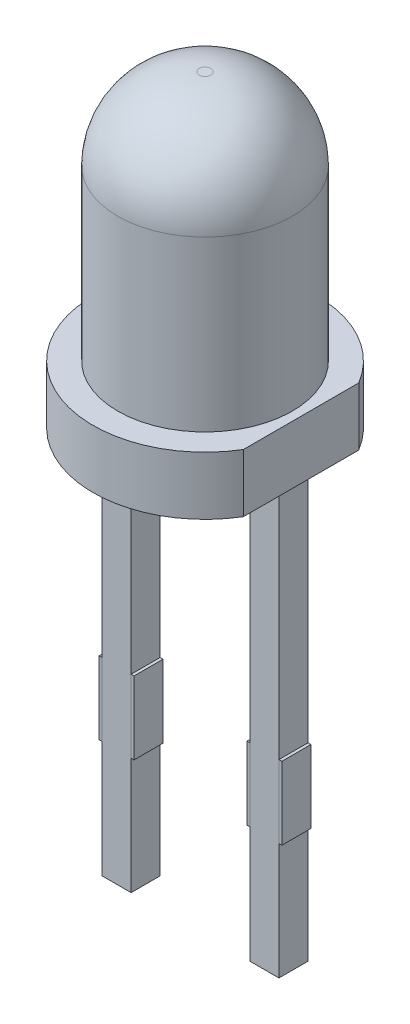
ISO-10303-21;
HEADER;
FILE_DESCRIPTION(('STEP AP214'),'2;1');
FILE_NAME('part.step','',(''),(''),'','','');
FILE_SCHEMA(('AUTOMOTIVE_DESIGN { 1 0 10303 214 1 1 1 1 }'));
ENDSEC;
DATA;
#1=APPLICATION_CONTEXT('core data for automotive mechanical design processes');
#2=APPLICATION_PROTOCOL_DEFINITION('international standard','automotive_design',2000,#1);
#3=PRODUCT_CONTEXT('',#1,'mechanical');
#4=PRODUCT('Part','Part','',(#3));
#5=PRODUCT_RELATED_PRODUCT_CATEGORY('part','',(#4));
#6=PRODUCT_DEFINITION_FORMATION('','',#4);
#7=PRODUCT_DEFINITION_CONTEXT('part definition',#1,'design');
#8=PRODUCT_DEFINITION('design','',#6,#7);
#9=PRODUCT_DEFINITION_SHAPE('','',#8);
#10=(LENGTH_UNIT() NAMED_UNIT(*) SI_UNIT(.MILLI.,.METRE.));
#11=(NAMED_UNIT(*) PLANE_ANGLE_UNIT() SI_UNIT($,.RADIAN.));
#12=(NAMED_UNIT(*) SI_UNIT($,.STERADIAN.) SOLID_ANGLE_UNIT());
#13=UNCERTAINTY_MEASURE_WITH_UNIT(LENGTH_MEASURE(1.E-05),#10,'distance_accuracy_value','');
#14=(GEOMETRIC_REPRESENTATION_CONTEXT(3) GLOBAL_UNCERTAINTY_ASSIGNED_CONTEXT((#13)) GLOBAL_UNIT_ASSIGNED_CONTEXT((#10,
#11,#12)) REPRESENTATION_CONTEXT('',''));
#15=CARTESIAN_POINT('',(0.,0.,0.));
#16=DIRECTION('',(0.,0.,1.));
#17=DIRECTION('',(1.,0.,0.));
#18=AXIS2_PLACEMENT_3D('',#15,#16,#17);
#19=CARTESIAN_POINT('',(-0.970022466230411,1.25,0.249999999999999));
#20=DIRECTION('',(0.,0.,1.));
#21=DIRECTION('',(1.,0.,0.));
#22=AXIS2_PLACEMENT_3D('',#19,#20,#21);
#23=PLANE('',#22);
#24=DIRECTION('',(1.,0.,0.));
#25=VECTOR('',#24,1.);
#26=CARTESIAN_POINT('',(-1.27002246623041,0.,0.249999999999999));
#27=LINE('',#26,#25);
#28=CARTESIAN_POINT('',(-0.970022466230411,0.,0.249999999999999));
#29=VERTEX_POINT('',#28);
#30=CARTESIAN_POINT('',(-1.57002246623041,0.,0.249999999999999));
#31=VERTEX_POINT('',#30);
#32=EDGE_CURVE('P0_E54',#29,#31,#27,.F.);
#33=ORIENTED_EDGE('',*,*,#32,.F.);
#34=DIRECTION('',(0.,1.,0.));
#35=VECTOR('',#34,1.);
#36=CARTESIAN_POINT('',(-0.970022466230411,1.25,0.249999999999999));
#37=LINE('',#36,#35);
#38=CARTESIAN_POINT('',(-0.970022466230411,1.25,0.249999999999999));
#39=VERTEX_POINT('',#38);
#40=EDGE_CURVE('P0_E66',#39,#29,#37,.F.);
#41=ORIENTED_EDGE('',*,*,#40,.F.);
#42=DIRECTION('',(-1.,0.,0.));
#43=VECTOR('',#42,1.);
#44=CARTESIAN_POINT('',(-1.27002246623041,1.25,0.249999999999999));
#45=LINE('',#44,#43);
#46=CARTESIAN_POINT('',(-1.57002246623041,1.25,0.249999999999999));
#47=VERTEX_POINT('',#46);
#48=EDGE_CURVE('P0_E19',#47,#39,#45,.F.);
#49=ORIENTED_EDGE('',*,*,#48,.F.);
#50=DIRECTION('',(0.,1.,0.));
#51=VECTOR('',#50,1.);
#52=CARTESIAN_POINT('',(-1.57002246623041,1.25,0.249999999999999));
#53=LINE('',#52,#51);
#54=EDGE_CURVE('P0_E80',#31,#47,#53,.T.);
#55=ORIENTED_EDGE('',*,*,#54,.F.);
#56=EDGE_LOOP('',(#33,#41,#49,#55));
#57=FACE_BOUND('',#56,.T.);
#58=ADVANCED_FACE('P0_F16',(#57),#23,.T.);
#59=CARTESIAN_POINT('',(-1.27002246623041,1.25,0.));
#60=DIRECTION('',(0.,1.,0.));
#61=DIRECTION('',(-1.,0.,0.));
#62=AXIS2_PLACEMENT_3D('',#59,#60,#61);
#63=PLANE('',#62);
#64=DIRECTION('',(-1.,0.,0.));
#65=VECTOR('',#64,1.);
#66=CARTESIAN_POINT('',(-1.57002246623041,1.25,-0.250000000000001));
#67=LINE('',#66,#65);
#68=CARTESIAN_POINT('',(-1.57002246623041,1.25,-0.250000000000001));
#69=VERTEX_POINT('',#68);
#70=CARTESIAN_POINT('',(-0.970022466230411,1.25,-0.250000000000001));
#71=VERTEX_POINT('',#70);
#72=EDGE_CURVE('P0_E82',#69,#71,#67,.F.);
#73=ORIENTED_EDGE('',*,*,#72,.F.);
#74=DIRECTION('',(0.,0.,1.));
#75=VECTOR('',#74,1.);
#76=CARTESIAN_POINT('',(-1.57002246623041,1.25,0.249999999999999));
#77=LINE('',#76,#75);
#78=EDGE_CURVE('P0_E64',#47,#69,#77,.F.);
#79=ORIENTED_EDGE('',*,*,#78,.F.);
#80=ORIENTED_EDGE('',*,*,#48,.T.);
#81=DIRECTION('',(0.,0.,-1.));
#82=VECTOR('',#81,1.);
#83=CARTESIAN_POINT('',(-0.970022466230411,1.25,-0.250000000000001));
#84=LINE('',#83,#82);
#85=EDGE_CURVE('P0_E61',#71,#39,#84,.F.);
#86=ORIENTED_EDGE('',*,*,#85,.F.);
#87=EDGE_LOOP('',(#73,#79,#80,#86));
#88=FACE_BOUND('',#87,.T.);
#89=ADVANCED_FACE('P0_F59',(#88),#63,.T.);
#90=CARTESIAN_POINT('',(-0.970022466230411,1.25,-0.250000000000001));
#91=DIRECTION('',(1.,0.,0.));
#92=DIRECTION('',(0.,0.,-1.));
#93=AXIS2_PLACEMENT_3D('',#90,#91,#92);
#94=PLANE('',#93);
#95=DIRECTION('',(0.,0.,1.));
#96=VECTOR('',#95,1.);
#97=CARTESIAN_POINT('',(-0.970022466230411,0.,0.));
#98=LINE('',#97,#96);
#99=CARTESIAN_POINT('',(-0.970022466230411,0.,-0.250000000000001));
#100=VERTEX_POINT('',#99);
#101=EDGE_CURVE('P0_E76',#100,#29,#98,.T.);
#102=ORIENTED_EDGE('',*,*,#101,.F.);
#103=DIRECTION('',(0.,1.,0.));
#104=VECTOR('',#103,1.);
#105=CARTESIAN_POINT('',(-0.970022466230411,1.25,-0.250000000000001));
#106=LINE('',#105,#104);
#107=EDGE_CURVE('P0_E72',#71,#100,#106,.F.);
#108=ORIENTED_EDGE('',*,*,#107,.F.);
#109=ORIENTED_EDGE('',*,*,#85,.T.);
#110=ORIENTED_EDGE('',*,*,#40,.T.);
#111=EDGE_LOOP('',(#102,#108,#109,#110));
#112=FACE_BOUND('',#111,.T.);
#113=ADVANCED_FACE('P0_F70',(#112),#94,.T.);
#114=CARTESIAN_POINT('',(-1.27002246623041,0.,0.));
#115=DIRECTION('',(0.,-1.,0.));
#116=DIRECTION('',(1.,0.,0.));
#117=AXIS2_PLACEMENT_3D('',#114,#115,#116);
#118=PLANE('',#117);
#119=DIRECTION('',(-1.,0.,0.));
#120=VECTOR('',#119,1.);
#121=CARTESIAN_POINT('',(-1.57002246623041,0.,-0.250000000000001));
#122=LINE('',#121,#120);
#123=CARTESIAN_POINT('',(-1.57002246623041,0.,-0.250000000000001));
#124=VERTEX_POINT('',#123);
#125=EDGE_CURVE('P0_E25',#100,#124,#122,.T.);
#126=ORIENTED_EDGE('',*,*,#125,.F.);
#127=ORIENTED_EDGE('',*,*,#101,.T.);
#128=ORIENTED_EDGE('',*,*,#32,.T.);
#129=DIRECTION('',(0.,0.,1.));
#130=VECTOR('',#129,1.);
#131=CARTESIAN_POINT('',(-1.57002246623041,0.,0.249999999999999));
#132=LINE('',#131,#130);
#133=EDGE_CURVE('P0_E34',#124,#31,#132,.T.);
#134=ORIENTED_EDGE('',*,*,#133,.F.);
#135=EDGE_LOOP('',(#126,#127,#128,#134));
#136=FACE_BOUND('',#135,.T.);
#137=ADVANCED_FACE('P0_F88',(#136),#118,.T.);
#138=CARTESIAN_POINT('',(-1.57002246623041,1.25,0.249999999999999));
#139=DIRECTION('',(-1.,0.,0.));
#140=DIRECTION('',(0.,0.,1.));
#141=AXIS2_PLACEMENT_3D('',#138,#139,#140);
#142=PLANE('',#141);
#143=ORIENTED_EDGE('',*,*,#133,.T.);
#144=ORIENTED_EDGE('',*,*,#54,.T.);
#145=ORIENTED_EDGE('',*,*,#78,.T.);
#146=DIRECTION('',(0.,1.,0.));
#147=VECTOR('',#146,1.);
#148=CARTESIAN_POINT('',(-1.57002246623041,1.25,-0.250000000000001));
#149=LINE('',#148,#147);
#150=EDGE_CURVE('P0_E11',#124,#69,#149,.T.);
#151=ORIENTED_EDGE('',*,*,#150,.F.);
#152=EDGE_LOOP('',(#143,#144,#145,#151));
#153=FACE_BOUND('',#152,.T.);
#154=ADVANCED_FACE('P0_F90',(#153),#142,.T.);
#155=CARTESIAN_POINT('',(-1.57002246623041,1.25,-0.250000000000001));
#156=DIRECTION('',(0.,0.,-1.));
#157=DIRECTION('',(-1.,0.,0.));
#158=AXIS2_PLACEMENT_3D('',#155,#156,#157);
#159=PLANE('',#158);
#160=ORIENTED_EDGE('',*,*,#125,.T.);
#161=ORIENTED_EDGE('',*,*,#150,.T.);
#162=ORIENTED_EDGE('',*,*,#72,.T.);
#163=ORIENTED_EDGE('',*,*,#107,.T.);
#164=EDGE_LOOP('',(#160,#161,#162,#163));
#165=FACE_BOUND('',#164,.T.);
#166=ADVANCED_FACE('P0_F87',(#165),#159,.T.);
#167=CLOSED_SHELL('',(#58,#89,#113,#137,#154,#166));
#168=MANIFOLD_SOLID_BREP('P0_B1',#167);
#169=CARTESIAN_POINT('',(-1.01999994039536,5.3,0.249999999999999));
#170=DIRECTION('',(0.,0.,1.));
#171=DIRECTION('',(1.,0.,0.));
#172=AXIS2_PLACEMENT_3D('',#169,#170,#171);
#173=PLANE('',#172);
#174=DIRECTION('',(1.,0.,0.));
#175=VECTOR('',#174,1.);
#176=CARTESIAN_POINT('',(-1.26999994039536,-2.,0.249999999999999));
#177=LINE('',#176,#175);
#178=CARTESIAN_POINT('',(-1.01999994039536,-2.,0.249999999999999));
#179=VERTEX_POINT('',#178);
#180=CARTESIAN_POINT('',(-1.51999994039536,-2.,0.249999999999999));
#181=VERTEX_POINT('',#180);
#182=EDGE_CURVE('P1_E67',#179,#181,#177,.F.);
#183=ORIENTED_EDGE('',*,*,#182,.F.);
#184=DIRECTION('',(0.,1.,0.));
#185=VECTOR('',#184,1.);
#186=CARTESIAN_POINT('',(-1.01999994039536,5.3,0.249999999999999));
#187=LINE('',#186,#185);
#188=CARTESIAN_POINT('',(-1.01999994039536,5.3,0.249999999999999));
#189=VERTEX_POINT('',#188);
#190=EDGE_CURVE('P1_E54',#189,#179,#187,.F.);
#191=ORIENTED_EDGE('',*,*,#190,.F.);
#192=DIRECTION('',(-1.,0.,0.));
#193=VECTOR('',#192,1.);
#194=CARTESIAN_POINT('',(-1.26999994039536,5.3,0.249999999999999));
#195=LINE('',#194,#193);
#196=CARTESIAN_POINT('',(-1.51999994039536,5.3,0.249999999999999));
#197=VERTEX_POINT('',#196);
#198=EDGE_CURVE('P1_E19',#197,#189,#195,.F.);
#199=ORIENTED_EDGE('',*,*,#198,.F.);
#200=DIRECTION('',(0.,1.,0.));
#201=VECTOR('',#200,1.);
#202=CARTESIAN_POINT('',(-1.51999994039536,5.3,0.249999999999999));
#203=LINE('',#202,#201);
#204=EDGE_CURVE('P1_E80',#181,#197,#203,.T.);
#205=ORIENTED_EDGE('',*,*,#204,.F.);
#206=EDGE_LOOP('',(#183,#191,#199,#205));
#207=FACE_BOUND('',#206,.T.);
#208=ADVANCED_FACE('P1_F16',(#207),#173,.T.);
#209=CARTESIAN_POINT('',(-1.26999994039536,5.3,0.));
#210=DIRECTION('',(0.,1.,0.));
#211=DIRECTION('',(-1.,0.,0.));
#212=AXIS2_PLACEMENT_3D('',#209,#210,#211);
#213=PLANE('',#212);
#214=DIRECTION('',(0.,0.,1.));
#215=VECTOR('',#214,1.);
#216=CARTESIAN_POINT('',(-1.51999994039536,5.3,0.249999999999999));
#217=LINE('',#216,#215);
#218=CARTESIAN_POINT('',(-1.51999994039536,5.3,-0.250000000000001));
#219=VERTEX_POINT('',#218);
#220=EDGE_CURVE('P1_E63',#197,#219,#217,.F.);
#221=ORIENTED_EDGE('',*,*,#220,.F.);
#222=ORIENTED_EDGE('',*,*,#198,.T.);
#223=DIRECTION('',(0.,0.,-1.));
#224=VECTOR('',#223,1.);
#225=CARTESIAN_POINT('',(-1.01999994039536,5.3,-0.250000000000001));
#226=LINE('',#225,#224);
#227=CARTESIAN_POINT('',(-1.01999994039536,5.3,-0.250000000000001));
#228=VERTEX_POINT('',#227);
#229=EDGE_CURVE('P1_E60',#228,#189,#226,.F.);
#230=ORIENTED_EDGE('',*,*,#229,.F.);
#231=DIRECTION('',(-1.,0.,0.));
#232=VECTOR('',#231,1.);
#233=CARTESIAN_POINT('',(-1.51999994039536,5.3,-0.250000000000001));
#234=LINE('',#233,#232);
#235=EDGE_CURVE('P1_E82',#219,#228,#234,.F.);
#236=ORIENTED_EDGE('',*,*,#235,.F.);
#237=EDGE_LOOP('',(#221,#222,#230,#236));
#238=FACE_BOUND('',#237,.T.);
#239=ADVANCED_FACE('P1_F59',(#238),#213,.T.);
#240=CARTESIAN_POINT('',(-1.01999994039536,5.3,-0.250000000000001));
#241=DIRECTION('',(1.,0.,0.));
#242=DIRECTION('',(0.,0.,-1.));
#243=AXIS2_PLACEMENT_3D('',#240,#241,#242);
#244=PLANE('',#243);
#245=DIRECTION('',(0.,0.,1.));
#246=VECTOR('',#245,1.);
#247=CARTESIAN_POINT('',(-1.01999994039536,-2.,0.));
#248=LINE('',#247,#246);
#249=CARTESIAN_POINT('',(-1.01999994039536,-2.,-0.250000000000001));
#250=VERTEX_POINT('',#249);
#251=EDGE_CURVE('P1_E69',#250,#179,#248,.T.);
#252=ORIENTED_EDGE('',*,*,#251,.F.);
#253=DIRECTION('',(0.,1.,0.));
#254=VECTOR('',#253,1.);
#255=CARTESIAN_POINT('',(-1.01999994039536,5.3,-0.250000000000001));
#256=LINE('',#255,#254);
#257=EDGE_CURVE('P1_E73',#228,#250,#256,.F.);
#258=ORIENTED_EDGE('',*,*,#257,.F.);
#259=ORIENTED_EDGE('',*,*,#229,.T.);
#260=ORIENTED_EDGE('',*,*,#190,.T.);
#261=EDGE_LOOP('',(#252,#258,#259,#260));
#262=FACE_BOUND('',#261,.T.);
#263=ADVANCED_FACE('P1_F71',(#262),#244,.T.);
#264=CARTESIAN_POINT('',(-1.26999994039536,-2.,0.));
#265=DIRECTION('',(0.,-1.,0.));
#266=DIRECTION('',(1.,0.,0.));
#267=AXIS2_PLACEMENT_3D('',#264,#265,#266);
#268=PLANE('',#267);
#269=DIRECTION('',(0.,0.,1.));
#270=VECTOR('',#269,1.);
#271=CARTESIAN_POINT('',(-1.51999994039536,-2.,0.249999999999999));
#272=LINE('',#271,#270);
#273=CARTESIAN_POINT('',(-1.51999994039536,-2.,-0.250000000000001));
#274=VERTEX_POINT('',#273);
#275=EDGE_CURVE('P1_E34',#274,#181,#272,.T.);
#276=ORIENTED_EDGE('',*,*,#275,.F.);
#277=DIRECTION('',(-1.,0.,0.));
#278=VECTOR('',#277,1.);
#279=CARTESIAN_POINT('',(-1.51999994039536,-2.,-0.250000000000001));
#280=LINE('',#279,#278);
#281=EDGE_CURVE('P1_E25',#250,#274,#280,.T.);
#282=ORIENTED_EDGE('',*,*,#281,.F.);
#283=ORIENTED_EDGE('',*,*,#251,.T.);
#284=ORIENTED_EDGE('',*,*,#182,.T.);
#285=EDGE_LOOP('',(#276,#282,#283,#284));
#286=FACE_BOUND('',#285,.T.);
#287=ADVANCED_FACE('P1_F88',(#286),#268,.T.);
#288=CARTESIAN_POINT('',(-1.51999994039536,5.3,0.249999999999999));
#289=DIRECTION('',(-1.,0.,0.));
#290=DIRECTION('',(0.,0.,1.));
#291=AXIS2_PLACEMENT_3D('',#288,#289,#290);
#292=PLANE('',#291);
#293=ORIENTED_EDGE('',*,*,#275,.T.);
#294=ORIENTED_EDGE('',*,*,#204,.T.);
#295=ORIENTED_EDGE('',*,*,#220,.T.);
#296=DIRECTION('',(0.,1.,0.));
#297=VECTOR('',#296,1.);
#298=CARTESIAN_POINT('',(-1.51999994039536,5.3,-0.250000000000001));
#299=LINE('',#298,#297);
#300=EDGE_CURVE('P1_E11',#274,#219,#299,.T.);
#301=ORIENTED_EDGE('',*,*,#300,.F.);
#302=EDGE_LOOP('',(#293,#294,#295,#301));
#303=FACE_BOUND('',#302,.T.);
#304=ADVANCED_FACE('P1_F90',(#303),#292,.T.);
#305=CARTESIAN_POINT('',(-1.51999994039536,5.3,-0.250000000000001));
#306=DIRECTION('',(0.,0.,-1.));
#307=DIRECTION('',(-1.,0.,0.));
#308=AXIS2_PLACEMENT_3D('',#305,#306,#307);
#309=PLANE('',#308);
#310=ORIENTED_EDGE('',*,*,#281,.T.);
#311=ORIENTED_EDGE('',*,*,#300,.T.);
#312=ORIENTED_EDGE('',*,*,#235,.T.);
#313=ORIENTED_EDGE('',*,*,#257,.T.);
#314=EDGE_LOOP('',(#310,#311,#312,#313));
#315=FACE_BOUND('',#314,.T.);
#316=ADVANCED_FACE('P1_F87',(#315),#309,.T.);
#317=CLOSED_SHELL('',(#208,#239,#263,#287,#304,#316));
#318=MANIFOLD_SOLID_BREP('P1_B1',#317);
#319=CARTESIAN_POINT('',(1.56997753376959,1.25,0.249999999999999));
#320=DIRECTION('',(0.,0.,1.));
#321=DIRECTION('',(1.,0.,0.));
#322=AXIS2_PLACEMENT_3D('',#319,#320,#321);
#323=PLANE('',#322);
#324=DIRECTION('',(1.,0.,0.));
#325=VECTOR('',#324,1.);
#326=CARTESIAN_POINT('',(1.26997753376959,0.,0.249999999999999));
#327=LINE('',#326,#325);
#328=CARTESIAN_POINT('',(1.56997753376959,0.,0.249999999999999));
#329=VERTEX_POINT('',#328);
#330=CARTESIAN_POINT('',(0.969977533769589,0.,0.249999999999999));
#331=VERTEX_POINT('',#330);
#332=EDGE_CURVE('P2_E67',#329,#331,#327,.F.);
#333=ORIENTED_EDGE('',*,*,#332,.F.);
#334=DIRECTION('',(0.,1.,0.));
#335=VECTOR('',#334,1.);
#336=CARTESIAN_POINT('',(1.56997753376959,1.25,0.249999999999999));
#337=LINE('',#336,#335);
#338=CARTESIAN_POINT('',(1.56997753376959,1.25,0.249999999999999));
#339=VERTEX_POINT('',#338);
#340=EDGE_CURVE('P2_E54',#339,#329,#337,.F.);
#341=ORIENTED_EDGE('',*,*,#340,.F.);
#342=DIRECTION('',(-1.,0.,0.));
#343=VECTOR('',#342,1.);
#344=CARTESIAN_POINT('',(1.26997753376959,1.25,0.249999999999999));
#345=LINE('',#344,#343);
#346=CARTESIAN_POINT('',(0.969977533769589,1.25,0.249999999999999));
#347=VERTEX_POINT('',#346);
#348=EDGE_CURVE('P2_E19',#347,#339,#345,.F.);
#349=ORIENTED_EDGE('',*,*,#348,.F.);
#350=DIRECTION('',(0.,1.,0.));
#351=VECTOR('',#350,1.);
#352=CARTESIAN_POINT('',(0.969977533769589,1.25,0.249999999999999));
#353=LINE('',#352,#351);
#354=EDGE_CURVE('P2_E80',#331,#347,#353,.T.);
#355=ORIENTED_EDGE('',*,*,#354,.F.);
#356=EDGE_LOOP('',(#333,#341,#349,#355));
#357=FACE_BOUND('',#356,.T.);
#358=ADVANCED_FACE('P2_F16',(#357),#323,.T.);
#359=CARTESIAN_POINT('',(1.26997753376959,1.25,0.));
#360=DIRECTION('',(0.,1.,0.));
#361=DIRECTION('',(-1.,0.,0.));
#362=AXIS2_PLACEMENT_3D('',#359,#360,#361);
#363=PLANE('',#362);
#364=DIRECTION('',(0.,0.,1.));
#365=VECTOR('',#364,1.);
#366=CARTESIAN_POINT('',(0.969977533769589,1.25,0.249999999999999));
#367=LINE('',#366,#365);
#368=CARTESIAN_POINT('',(0.969977533769589,1.25,-0.250000000000001));
#369=VERTEX_POINT('',#368);
#370=EDGE_CURVE('P2_E63',#347,#369,#367,.F.);
#371=ORIENTED_EDGE('',*,*,#370,.F.);
#372=ORIENTED_EDGE('',*,*,#348,.T.);
#373=DIRECTION('',(0.,0.,-1.));
#374=VECTOR('',#373,1.);
#375=CARTESIAN_POINT('',(1.56997753376959,1.25,-0.250000000000001));
#376=LINE('',#375,#374);
#377=CARTESIAN_POINT('',(1.56997753376959,1.25,-0.250000000000001));
#378=VERTEX_POINT('',#377);
#379=EDGE_CURVE('P2_E60',#378,#339,#376,.F.);
#380=ORIENTED_EDGE('',*,*,#379,.F.);
#381=DIRECTION('',(-1.,0.,0.));
#382=VECTOR('',#381,1.);
#383=CARTESIAN_POINT('',(0.969977533769589,1.25,-0.250000000000001));
#384=LINE('',#383,#382);
#385=EDGE_CURVE('P2_E82',#369,#378,#384,.F.);
#386=ORIENTED_EDGE('',*,*,#385,.F.);
#387=EDGE_LOOP('',(#371,#372,#380,#386));
#388=FACE_BOUND('',#387,.T.);
#389=ADVANCED_FACE('P2_F59',(#388),#363,.T.);
#390=CARTESIAN_POINT('',(1.56997753376959,1.25,-0.250000000000001));
#391=DIRECTION('',(1.,0.,0.));
#392=DIRECTION('',(0.,0.,-1.));
#393=AXIS2_PLACEMENT_3D('',#390,#391,#392);
#394=PLANE('',#393);
#395=DIRECTION('',(0.,0.,1.));
#396=VECTOR('',#395,1.);
#397=CARTESIAN_POINT('',(1.56997753376959,0.,0.));
#398=LINE('',#397,#396);
#399=CARTESIAN_POINT('',(1.56997753376959,0.,-0.250000000000001));
#400=VERTEX_POINT('',#399);
#401=EDGE_CURVE('P2_E69',#400,#329,#398,.T.);
#402=ORIENTED_EDGE('',*,*,#401,.F.);
#403=DIRECTION('',(0.,1.,0.));
#404=VECTOR('',#403,1.);
#405=CARTESIAN_POINT('',(1.56997753376959,1.25,-0.250000000000001));
#406=LINE('',#405,#404);
#407=EDGE_CURVE('P2_E73',#378,#400,#406,.F.);
#408=ORIENTED_EDGE('',*,*,#407,.F.);
#409=ORIENTED_EDGE('',*,*,#379,.T.);
#410=ORIENTED_EDGE('',*,*,#340,.T.);
#411=EDGE_LOOP('',(#402,#408,#409,#410));
#412=FACE_BOUND('',#411,.T.);
#413=ADVANCED_FACE('P2_F71',(#412),#394,.T.);
#414=CARTESIAN_POINT('',(1.26997753376959,0.,0.));
#415=DIRECTION('',(0.,-1.,0.));
#416=DIRECTION('',(1.,0.,0.));
#417=AXIS2_PLACEMENT_3D('',#414,#415,#416);
#418=PLANE('',#417);
#419=DIRECTION('',(0.,0.,1.));
#420=VECTOR('',#419,1.);
#421=CARTESIAN_POINT('',(0.969977533769589,0.,0.249999999999999));
#422=LINE('',#421,#420);
#423=CARTESIAN_POINT('',(0.969977533769589,0.,-0.250000000000001));
#424=VERTEX_POINT('',#423);
#425=EDGE_CURVE('P2_E34',#424,#331,#422,.T.);
#426=ORIENTED_EDGE('',*,*,#425,.F.);
#427=DIRECTION('',(-1.,0.,0.));
#428=VECTOR('',#427,1.);
#429=CARTESIAN_POINT('',(0.969977533769589,0.,-0.250000000000001));
#430=LINE('',#429,#428);
#431=EDGE_CURVE('P2_E25',#400,#424,#430,.T.);
#432=ORIENTED_EDGE('',*,*,#431,.F.);
#433=ORIENTED_EDGE('',*,*,#401,.T.);
#434=ORIENTED_EDGE('',*,*,#332,.T.);
#435=EDGE_LOOP('',(#426,#432,#433,#434));
#436=FACE_BOUND('',#435,.T.);
#437=ADVANCED_FACE('P2_F88',(#436),#418,.T.);
#438=CARTESIAN_POINT('',(0.969977533769589,1.25,0.249999999999999));
#439=DIRECTION('',(-1.,0.,0.));
#440=DIRECTION('',(0.,0.,1.));
#441=AXIS2_PLACEMENT_3D('',#438,#439,#440);
#442=PLANE('',#441);
#443=ORIENTED_EDGE('',*,*,#425,.T.);
#444=ORIENTED_EDGE('',*,*,#354,.T.);
#445=ORIENTED_EDGE('',*,*,#370,.T.);
#446=DIRECTION('',(0.,1.,0.));
#447=VECTOR('',#446,1.);
#448=CARTESIAN_POINT('',(0.969977533769589,1.25,-0.250000000000001));
#449=LINE('',#448,#447);
#450=EDGE_CURVE('P2_E11',#424,#369,#449,.T.);
#451=ORIENTED_EDGE('',*,*,#450,.F.);
#452=EDGE_LOOP('',(#443,#444,#445,#451));
#453=FACE_BOUND('',#452,.T.);
#454=ADVANCED_FACE('P2_F90',(#453),#442,.T.);
#455=CARTESIAN_POINT('',(0.969977533769589,1.25,-0.250000000000001));
#456=DIRECTION('',(0.,0.,-1.));
#457=DIRECTION('',(-1.,0.,0.));
#458=AXIS2_PLACEMENT_3D('',#455,#456,#457);
#459=PLANE('',#458);
#460=ORIENTED_EDGE('',*,*,#431,.T.);
#461=ORIENTED_EDGE('',*,*,#450,.T.);
#462=ORIENTED_EDGE('',*,*,#385,.T.);
#463=ORIENTED_EDGE('',*,*,#407,.T.);
#464=EDGE_LOOP('',(#460,#461,#462,#463));
#465=FACE_BOUND('',#464,.T.);
#466=ADVANCED_FACE('P2_F87',(#465),#459,.T.);
#467=CLOSED_SHELL('',(#358,#389,#413,#437,#454,#466));
#468=MANIFOLD_SOLID_BREP('P2_B1',#467);
#469=CARTESIAN_POINT('',(0.,5.3,0.));
#470=DIRECTION('',(0.,-1.,0.));
#471=DIRECTION('',(0.,0.,-1.));
#472=AXIS2_PLACEMENT_3D('',#469,#470,#471);
#473=PLANE('',#472);
#474=DIRECTION('',(0.,0.,1.));
#475=VECTOR('',#474,1.);
#476=CARTESIAN_POINT('',(1.65025321659662,5.3,-3.00000004470348));
#477=LINE('',#476,#475);
#478=CARTESIAN_POINT('',(1.65025321659662,5.3,-0.991105100941625));
#479=VERTEX_POINT('',#478);
#480=CARTESIAN_POINT('',(1.65025321659662,5.3,0.991105100941623));
#481=VERTEX_POINT('',#480);
#482=EDGE_CURVE('P3_E48',#479,#481,#477,.T.);
#483=ORIENTED_EDGE('',*,*,#482,.T.);
#484=CARTESIAN_POINT('',(0.,5.3,0.));
#485=DIRECTION('',(0.,1.,0.));
#486=DIRECTION('',(0.,0.,1.));
#487=AXIS2_PLACEMENT_3D('',#484,#485,#486);
#488=CIRCLE('',#487,1.925);
#489=EDGE_CURVE('P3_E20',#479,#481,#488,.T.);
#490=ORIENTED_EDGE('',*,*,#489,.F.);
#491=EDGE_LOOP('',(#483,#490));
#492=FACE_BOUND('',#491,.T.);
#493=ADVANCED_FACE('P3_F16',(#492),#473,.T.);
#494=CARTESIAN_POINT('',(1.65025321659662,5.3,-3.00000004470348));
#495=DIRECTION('',(-1.,0.,0.));
#496=DIRECTION('',(0.,0.,1.));
#497=AXIS2_PLACEMENT_3D('',#494,#495,#496);
#498=PLANE('',#497);
#499=DIRECTION('',(0.,0.,1.));
#500=VECTOR('',#499,1.);
#501=CARTESIAN_POINT('',(1.65025321659662,6.3,0.));
#502=LINE('',#501,#500);
#503=CARTESIAN_POINT('',(1.65025321659662,6.3,0.991105100941622));
#504=VERTEX_POINT('',#503);
#505=CARTESIAN_POINT('',(1.65025321659662,6.3,-0.991105100941625));
#506=VERTEX_POINT('',#505);
#507=EDGE_CURVE('P3_E59',#504,#506,#502,.F.);
#508=ORIENTED_EDGE('',*,*,#507,.F.);
#509=DIRECTION('',(0.,1.,0.));
#510=VECTOR('',#509,1.);
#511=CARTESIAN_POINT('',(1.65025321659662,5.8,0.991105100941621));
#512=LINE('',#511,#510);
#513=EDGE_CURVE('P3_E56',#481,#504,#512,.T.);
#514=ORIENTED_EDGE('',*,*,#513,.F.);
#515=ORIENTED_EDGE('',*,*,#482,.F.);
#516=DIRECTION('',(0.,1.,0.));
#517=VECTOR('',#516,1.);
#518=CARTESIAN_POINT('',(1.65025321659662,5.8,-0.991105100941623));
#519=LINE('',#518,#517);
#520=EDGE_CURVE('P3_E53',#506,#479,#519,.F.);
#521=ORIENTED_EDGE('',*,*,#520,.F.);
#522=EDGE_LOOP('',(#508,#514,#515,#521));
#523=FACE_BOUND('',#522,.T.);
#524=ADVANCED_FACE('P3_F57',(#523),#498,.F.);
#525=CARTESIAN_POINT('',(0.,5.8,0.));
#526=DIRECTION('',(0.,1.,0.));
#527=DIRECTION('',(0.,0.,1.));
#528=AXIS2_PLACEMENT_3D('',#525,#526,#527);
#529=CYLINDRICAL_SURFACE('',#528,1.925);
#530=ORIENTED_EDGE('',*,*,#513,.T.);
#531=CARTESIAN_POINT('',(0.,6.3,0.));
#532=DIRECTION('',(0.,1.,0.));
#533=DIRECTION('',(0.,0.,1.));
#534=AXIS2_PLACEMENT_3D('',#531,#532,#533);
#535=CIRCLE('',#534,1.925);
#536=EDGE_CURVE('P3_E69',#506,#504,#535,.T.);
#537=ORIENTED_EDGE('',*,*,#536,.F.);
#538=ORIENTED_EDGE('',*,*,#520,.T.);
#539=ORIENTED_EDGE('',*,*,#489,.T.);
#540=EDGE_LOOP('',(#530,#537,#538,#539));
#541=FACE_BOUND('',#540,.T.);
#542=ADVANCED_FACE('P3_F64',(#541),#529,.T.);
#543=CARTESIAN_POINT('',(0.,10.6,0.));
#544=DIRECTION('',(0.,1.,0.));
#545=DIRECTION('',(0.,0.,1.));
#546=AXIS2_PLACEMENT_3D('',#543,#544,#545);
#547=PLANE('',#546);
#548=CARTESIAN_POINT('',(0.,10.6,0.));
#549=DIRECTION('',(0.,1.,0.));
#550=DIRECTION('',(0.,0.,1.));
#551=AXIS2_PLACEMENT_3D('',#548,#549,#550);
#552=CIRCLE('',#551,0.0999999999999999);
#553=CARTESIAN_POINT('',(0.,10.6,-0.100000000000003));
#554=VERTEX_POINT('',#553);
#555=CARTESIAN_POINT('',(0.0999999999999999,10.6,0.));
#556=VERTEX_POINT('',#555);
#557=EDGE_CURVE('P3_E34',#554,#556,#552,.T.);
#558=ORIENTED_EDGE('',*,*,#557,.T.);
#559=CARTESIAN_POINT('',(0.1,10.6,0.));
#560=CARTESIAN_POINT('',(0.1,10.6,-0.0408974612727251));
#561=CARTESIAN_POINT('',(0.0707106781186548,10.6,-0.0707106781186573));
#562=CARTESIAN_POINT('',(0.041936045018768,10.6,-0.100000000000003));
#563=CARTESIAN_POINT('',(0.,10.6,-0.100000000000003));
#564=B_SPLINE_CURVE_WITH_KNOTS('',2,(#559,#560,#561,#562,#563),.UNSPECIFIED.,.F.,.F.,(3,2,3),
(0.,0.5,1.),.UNSPECIFIED.);
#565=EDGE_CURVE('P3_E68',#556,#554,#564,.T.);
#566=ORIENTED_EDGE('',*,*,#565,.T.);
#567=EDGE_LOOP('',(#558,#566));
#568=FACE_BOUND('',#567,.T.);
#569=ADVANCED_FACE('P3_F77',(#568),#547,.T.);
#570=CARTESIAN_POINT('',(0.,6.3,0.));
#571=DIRECTION('',(0.,1.,0.));
#572=DIRECTION('',(0.,0.,1.));
#573=AXIS2_PLACEMENT_3D('',#570,#571,#572);
#574=PLANE('',#573);
#575=CARTESIAN_POINT('',(0.,6.3,0.));
#576=DIRECTION('',(0.,1.,0.));
#577=DIRECTION('',(0.,0.,1.));
#578=AXIS2_PLACEMENT_3D('',#575,#576,#577);
#579=CIRCLE('',#578,1.5);
#580=CARTESIAN_POINT('',(0.,6.3,1.5));
#581=VERTEX_POINT('',#580);
#582=EDGE_CURVE('P3_E11',#581,#581,#579,.T.);
#583=ORIENTED_EDGE('',*,*,#582,.F.);
#584=EDGE_LOOP('',(#583));
#585=FACE_BOUND('',#584,.T.);
#586=ORIENTED_EDGE('',*,*,#507,.T.);
#587=ORIENTED_EDGE('',*,*,#536,.T.);
#588=EDGE_LOOP('',(#586,#587));
#589=FACE_BOUND('',#588,.T.);
#590=ADVANCED_FACE('P3_F87',(#585,#589),#574,.T.);
#591=CARTESIAN_POINT('',(0.,9.2,0.));
#592=DIRECTION('',(0.,1.,0.));
#593=DIRECTION('',(0.,0.,1.));
#594=AXIS2_PLACEMENT_3D('',#591,#592,#593);
#595=DEGENERATE_TOROIDAL_SURFACE('',#594,0.100000000000001,1.4,.T.);
#596=CARTESIAN_POINT('',(0.,9.2,0.));
#597=DIRECTION('',(0.,1.,0.));
#598=DIRECTION('',(0.,0.,1.));
#599=AXIS2_PLACEMENT_3D('',#596,#597,#598);
#600=CIRCLE('',#599,1.5);
#601=CARTESIAN_POINT('',(0.,9.2,1.5));
#602=VERTEX_POINT('',#601);
#603=EDGE_CURVE('P3_E26',#602,#602,#600,.F.);
#604=ORIENTED_EDGE('',*,*,#603,.F.);
#605=EDGE_LOOP('',(#604));
#606=FACE_BOUND('',#605,.T.);
#607=ORIENTED_EDGE('',*,*,#557,.F.);
#608=ORIENTED_EDGE('',*,*,#565,.F.);
#609=EDGE_LOOP('',(#607,#608));
#610=FACE_BOUND('',#609,.T.);
#611=ADVANCED_FACE('P3_F18',(#606,#610),#595,.T.);
#612=CARTESIAN_POINT('',(0.,7.95,0.));
#613=DIRECTION('',(0.,1.,0.));
#614=DIRECTION('',(0.,0.,1.));
#615=AXIS2_PLACEMENT_3D('',#612,#613,#614);
#616=CYLINDRICAL_SURFACE('',#615,1.5);
#617=ORIENTED_EDGE('',*,*,#582,.T.);
#618=EDGE_LOOP('',(#617));
#619=FACE_BOUND('',#618,.T.);
#620=ORIENTED_EDGE('',*,*,#603,.T.);
#621=EDGE_LOOP('',(#620));
#622=FACE_BOUND('',#621,.T.);
#623=ADVANCED_FACE('P3_F96',(#619,#622),#616,.T.);
#624=CLOSED_SHELL('',(#493,#524,#542,#569,#590,#611,#623));
#625=MANIFOLD_SOLID_BREP('P3_B1',#624);
#626=CARTESIAN_POINT('',(1.52000005960464,5.3,0.249999999999999));
#627=DIRECTION('',(0.,0.,1.));
#628=DIRECTION('',(1.,0.,0.));
#629=AXIS2_PLACEMENT_3D('',#626,#627,#628);
#630=PLANE('',#629);
#631=DIRECTION('',(1.,0.,0.));
#632=VECTOR('',#631,1.);
#633=CARTESIAN_POINT('',(1.27000005960464,-2.,0.249999999999999));
#634=LINE('',#633,#632);
#635=CARTESIAN_POINT('',(1.52000005960464,-2.,0.249999999999999));
#636=VERTEX_POINT('',#635);
#637=CARTESIAN_POINT('',(1.02000005960464,-2.,0.249999999999999));
#638=VERTEX_POINT('',#637);
#639=EDGE_CURVE('P4_E67',#636,#638,#634,.F.);
#640=ORIENTED_EDGE('',*,*,#639,.F.);
#641=DIRECTION('',(0.,1.,0.));
#642=VECTOR('',#641,1.);
#643=CARTESIAN_POINT('',(1.52000005960464,5.3,0.249999999999999));
#644=LINE('',#643,#642);
#645=CARTESIAN_POINT('',(1.52000005960464,5.3,0.249999999999999));
#646=VERTEX_POINT('',#645);
#647=EDGE_CURVE('P4_E54',#646,#636,#644,.F.);
#648=ORIENTED_EDGE('',*,*,#647,.F.);
#649=DIRECTION('',(-1.,0.,0.));
#650=VECTOR('',#649,1.);
#651=CARTESIAN_POINT('',(1.27000005960464,5.3,0.249999999999999));
#652=LINE('',#651,#650);
#653=CARTESIAN_POINT('',(1.02000005960464,5.3,0.249999999999999));
#654=VERTEX_POINT('',#653);
#655=EDGE_CURVE('P4_E19',#654,#646,#652,.F.);
#656=ORIENTED_EDGE('',*,*,#655,.F.);
#657=DIRECTION('',(0.,1.,0.));
#658=VECTOR('',#657,1.);
#659=CARTESIAN_POINT('',(1.02000005960464,5.3,0.249999999999999));
#660=LINE('',#659,#658);
#661=EDGE_CURVE('P4_E80',#638,#654,#660,.T.);
#662=ORIENTED_EDGE('',*,*,#661,.F.);
#663=EDGE_LOOP('',(#640,#648,#656,#662));
#664=FACE_BOUND('',#663,.T.);
#665=ADVANCED_FACE('P4_F16',(#664),#630,.T.);
#666=CARTESIAN_POINT('',(1.27000005960464,5.3,0.));
#667=DIRECTION('',(0.,1.,0.));
#668=DIRECTION('',(-1.,0.,0.));
#669=AXIS2_PLACEMENT_3D('',#666,#667,#668);
#670=PLANE('',#669);
#671=DIRECTION('',(0.,0.,1.));
#672=VECTOR('',#671,1.);
#673=CARTESIAN_POINT('',(1.02000005960464,5.3,0.249999999999999));
#674=LINE('',#673,#672);
#675=CARTESIAN_POINT('',(1.02000005960464,5.3,-0.250000000000001));
#676=VERTEX_POINT('',#675);
#677=EDGE_CURVE('P4_E63',#654,#676,#674,.F.);
#678=ORIENTED_EDGE('',*,*,#677,.F.);
#679=ORIENTED_EDGE('',*,*,#655,.T.);
#680=DIRECTION('',(0.,0.,-1.));
#681=VECTOR('',#680,1.);
#682=CARTESIAN_POINT('',(1.52000005960464,5.3,-0.250000000000001));
#683=LINE('',#682,#681);
#684=CARTESIAN_POINT('',(1.52000005960464,5.3,-0.250000000000001));
#685=VERTEX_POINT('',#684);
#686=EDGE_CURVE('P4_E60',#685,#646,#683,.F.);
#687=ORIENTED_EDGE('',*,*,#686,.F.);
#688=DIRECTION('',(-1.,0.,0.));
#689=VECTOR('',#688,1.);
#690=CARTESIAN_POINT('',(1.02000005960464,5.3,-0.250000000000001));
#691=LINE('',#690,#689);
#692=EDGE_CURVE('P4_E82',#676,#685,#691,.F.);
#693=ORIENTED_EDGE('',*,*,#692,.F.);
#694=EDGE_LOOP('',(#678,#679,#687,#693));
#695=FACE_BOUND('',#694,.T.);
#696=ADVANCED_FACE('P4_F59',(#695),#670,.T.);
#697=CARTESIAN_POINT('',(1.52000005960464,5.3,-0.250000000000001));
#698=DIRECTION('',(1.,0.,0.));
#699=DIRECTION('',(0.,0.,-1.));
#700=AXIS2_PLACEMENT_3D('',#697,#698,#699);
#701=PLANE('',#700);
#702=DIRECTION('',(0.,0.,1.));
#703=VECTOR('',#702,1.);
#704=CARTESIAN_POINT('',(1.52000005960464,-2.,0.));
#705=LINE('',#704,#703);
#706=CARTESIAN_POINT('',(1.52000005960464,-2.,-0.250000000000001));
#707=VERTEX_POINT('',#706);
#708=EDGE_CURVE('P4_E69',#707,#636,#705,.T.);
#709=ORIENTED_EDGE('',*,*,#708,.F.);
#710=DIRECTION('',(0.,1.,0.));
#711=VECTOR('',#710,1.);
#712=CARTESIAN_POINT('',(1.52000005960464,5.3,-0.250000000000001));
#713=LINE('',#712,#711);
#714=EDGE_CURVE('P4_E73',#685,#707,#713,.F.);
#715=ORIENTED_EDGE('',*,*,#714,.F.);
#716=ORIENTED_EDGE('',*,*,#686,.T.);
#717=ORIENTED_EDGE('',*,*,#647,.T.);
#718=EDGE_LOOP('',(#709,#715,#716,#717));
#719=FACE_BOUND('',#718,.T.);
#720=ADVANCED_FACE('P4_F71',(#719),#701,.T.);
#721=CARTESIAN_POINT('',(1.27000005960464,-2.,0.));
#722=DIRECTION('',(0.,-1.,0.));
#723=DIRECTION('',(1.,0.,0.));
#724=AXIS2_PLACEMENT_3D('',#721,#722,#723);
#725=PLANE('',#724);
#726=DIRECTION('',(0.,0.,1.));
#727=VECTOR('',#726,1.);
#728=CARTESIAN_POINT('',(1.02000005960464,-2.,0.249999999999999));
#729=LINE('',#728,#727);
#730=CARTESIAN_POINT('',(1.02000005960464,-2.,-0.250000000000001));
#731=VERTEX_POINT('',#730);
#732=EDGE_CURVE('P4_E34',#731,#638,#729,.T.);
#733=ORIENTED_EDGE('',*,*,#732,.F.);
#734=DIRECTION('',(-1.,0.,0.));
#735=VECTOR('',#734,1.);
#736=CARTESIAN_POINT('',(1.02000005960464,-2.,-0.250000000000001));
#737=LINE('',#736,#735);
#738=EDGE_CURVE('P4_E25',#707,#731,#737,.T.);
#739=ORIENTED_EDGE('',*,*,#738,.F.);
#740=ORIENTED_EDGE('',*,*,#708,.T.);
#741=ORIENTED_EDGE('',*,*,#639,.T.);
#742=EDGE_LOOP('',(#733,#739,#740,#741));
#743=FACE_BOUND('',#742,.T.);
#744=ADVANCED_FACE('P4_F88',(#743),#725,.T.);
#745=CARTESIAN_POINT('',(1.02000005960464,5.3,0.249999999999999));
#746=DIRECTION('',(-1.,0.,0.));
#747=DIRECTION('',(0.,0.,1.));
#748=AXIS2_PLACEMENT_3D('',#745,#746,#747);
#749=PLANE('',#748);
#750=ORIENTED_EDGE('',*,*,#732,.T.);
#751=ORIENTED_EDGE('',*,*,#661,.T.);
#752=ORIENTED_EDGE('',*,*,#677,.T.);
#753=DIRECTION('',(0.,1.,0.));
#754=VECTOR('',#753,1.);
#755=CARTESIAN_POINT('',(1.02000005960464,5.3,-0.250000000000001));
#756=LINE('',#755,#754);
#757=EDGE_CURVE('P4_E11',#731,#676,#756,.T.);
#758=ORIENTED_EDGE('',*,*,#757,.F.);
#759=EDGE_LOOP('',(#750,#751,#752,#758));
#760=FACE_BOUND('',#759,.T.);
#761=ADVANCED_FACE('P4_F90',(#760),#749,.T.);
#762=CARTESIAN_POINT('',(1.02000005960464,5.3,-0.250000000000001));
#763=DIRECTION('',(0.,0.,-1.));
#764=DIRECTION('',(-1.,0.,0.));
#765=AXIS2_PLACEMENT_3D('',#762,#763,#764);
#766=PLANE('',#765);
#767=ORIENTED_EDGE('',*,*,#738,.T.);
#768=ORIENTED_EDGE('',*,*,#757,.T.);
#769=ORIENTED_EDGE('',*,*,#692,.T.);
#770=ORIENTED_EDGE('',*,*,#714,.T.);
#771=EDGE_LOOP('',(#767,#768,#769,#770));
#772=FACE_BOUND('',#771,.T.);
#773=ADVANCED_FACE('P4_F87',(#772),#766,.T.);
#774=CLOSED_SHELL('',(#665,#696,#720,#744,#761,#773));
#775=MANIFOLD_SOLID_BREP('P4_B1',#774);
#776=ADVANCED_BREP_SHAPE_REPRESENTATION('',(#18,#168,#318,#468,#625,#775),#14);
#777=SHAPE_DEFINITION_REPRESENTATION(#9,#776);
ENDSEC;
END-ISO-10303-21;
